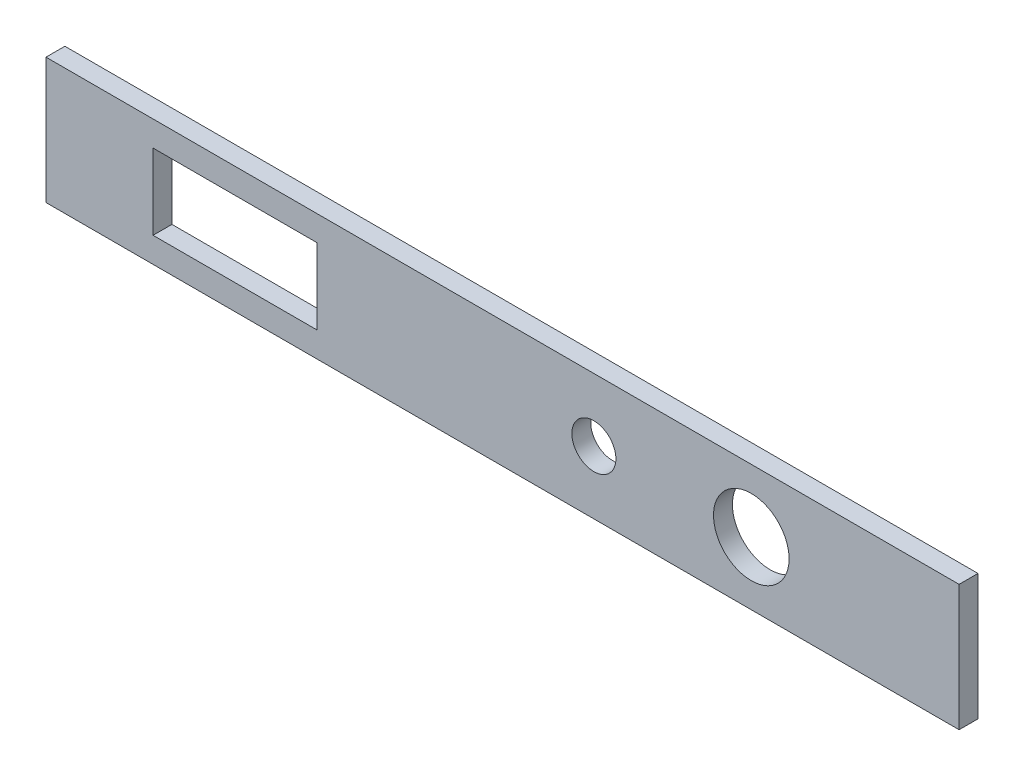
ISO-10303-21;
HEADER;
FILE_DESCRIPTION(('STEP AP214'),'2;1');
FILE_NAME('part.step','',(''),(''),'','','');
FILE_SCHEMA(('AUTOMOTIVE_DESIGN { 1 0 10303 214 1 1 1 1 }'));
ENDSEC;
DATA;
#1=APPLICATION_CONTEXT('core data for automotive mechanical design processes');
#2=APPLICATION_PROTOCOL_DEFINITION('international standard','automotive_design',2000,#1);
#3=PRODUCT_CONTEXT('',#1,'mechanical');
#4=PRODUCT('Part','Part','',(#3));
#5=PRODUCT_RELATED_PRODUCT_CATEGORY('part','',(#4));
#6=PRODUCT_DEFINITION_FORMATION('','',#4);
#7=PRODUCT_DEFINITION_CONTEXT('part definition',#1,'design');
#8=PRODUCT_DEFINITION('design','',#6,#7);
#9=PRODUCT_DEFINITION_SHAPE('','',#8);
#10=(LENGTH_UNIT() NAMED_UNIT(*) SI_UNIT(.MILLI.,.METRE.));
#11=(NAMED_UNIT(*) PLANE_ANGLE_UNIT() SI_UNIT($,.RADIAN.));
#12=(NAMED_UNIT(*) SI_UNIT($,.STERADIAN.) SOLID_ANGLE_UNIT());
#13=UNCERTAINTY_MEASURE_WITH_UNIT(LENGTH_MEASURE(1.E-05),#10,'distance_accuracy_value','');
#14=(GEOMETRIC_REPRESENTATION_CONTEXT(3) GLOBAL_UNCERTAINTY_ASSIGNED_CONTEXT((#13)) GLOBAL_UNIT_ASSIGNED_CONTEXT((#10,
#11,#12)) REPRESENTATION_CONTEXT('',''));
#15=CARTESIAN_POINT('',(0.,0.,0.));
#16=DIRECTION('',(0.,0.,1.));
#17=DIRECTION('',(1.,0.,0.));
#18=AXIS2_PLACEMENT_3D('',#15,#16,#17);
#19=CARTESIAN_POINT('',(0.,0.,3.));
#20=DIRECTION('',(1.,0.,0.));
#21=DIRECTION('',(0.,0.,-1.));
#22=AXIS2_PLACEMENT_3D('',#19,#20,#21);
#23=PLANE('',#22);
#24=DIRECTION('',(0.,-1.,0.));
#25=VECTOR('',#24,1.);
#26=CARTESIAN_POINT('',(0.,0.,0.));
#27=LINE('',#26,#25);
#28=CARTESIAN_POINT('',(0.,20.,0.));
#29=VERTEX_POINT('',#28);
#30=CARTESIAN_POINT('',(0.,0.,0.));
#31=VERTEX_POINT('',#30);
#32=EDGE_CURVE('E148',#29,#31,#27,.T.);
#33=ORIENTED_EDGE('',*,*,#32,.T.);
#34=DIRECTION('',(0.,0.,-1.));
#35=VECTOR('',#34,1.);
#36=CARTESIAN_POINT('',(0.,0.,3.));
#37=LINE('',#36,#35);
#38=CARTESIAN_POINT('',(0.,0.,3.));
#39=VERTEX_POINT('',#38);
#40=EDGE_CURVE('E11',#39,#31,#37,.T.);
#41=ORIENTED_EDGE('',*,*,#40,.F.);
#42=DIRECTION('',(0.,-1.,0.));
#43=VECTOR('',#42,1.);
#44=CARTESIAN_POINT('',(0.,0.,3.));
#45=LINE('',#44,#43);
#46=CARTESIAN_POINT('',(0.,20.,3.));
#47=VERTEX_POINT('',#46);
#48=EDGE_CURVE('E169',#47,#39,#45,.T.);
#49=ORIENTED_EDGE('',*,*,#48,.F.);
#50=DIRECTION('',(0.,0.,-1.));
#51=VECTOR('',#50,1.);
#52=CARTESIAN_POINT('',(0.,20.,3.));
#53=LINE('',#52,#51);
#54=EDGE_CURVE('E183',#47,#29,#53,.T.);
#55=ORIENTED_EDGE('',*,*,#54,.T.);
#56=EDGE_LOOP('',(#33,#41,#49,#55));
#57=FACE_BOUND('',#56,.T.);
#58=ADVANCED_FACE('F39',(#57),#23,.F.);
#59=CARTESIAN_POINT('',(0.,0.,3.));
#60=DIRECTION('',(0.,1.,0.));
#61=DIRECTION('',(0.,0.,1.));
#62=AXIS2_PLACEMENT_3D('',#59,#60,#61);
#63=PLANE('',#62);
#64=DIRECTION('',(1.,0.,0.));
#65=VECTOR('',#64,1.);
#66=CARTESIAN_POINT('',(0.,0.,0.));
#67=LINE('',#66,#65);
#68=CARTESIAN_POINT('',(145.,0.,0.));
#69=VERTEX_POINT('',#68);
#70=EDGE_CURVE('E187',#31,#69,#67,.T.);
#71=ORIENTED_EDGE('',*,*,#70,.T.);
#72=DIRECTION('',(0.,0.,-1.));
#73=VECTOR('',#72,1.);
#74=CARTESIAN_POINT('',(145.,0.,3.));
#75=LINE('',#74,#73);
#76=CARTESIAN_POINT('',(145.,0.,3.));
#77=VERTEX_POINT('',#76);
#78=EDGE_CURVE('E47',#77,#69,#75,.T.);
#79=ORIENTED_EDGE('',*,*,#78,.F.);
#80=DIRECTION('',(1.,0.,0.));
#81=VECTOR('',#80,1.);
#82=CARTESIAN_POINT('',(0.,0.,3.));
#83=LINE('',#82,#81);
#84=EDGE_CURVE('E173',#39,#77,#83,.T.);
#85=ORIENTED_EDGE('',*,*,#84,.F.);
#86=ORIENTED_EDGE('',*,*,#40,.T.);
#87=EDGE_LOOP('',(#71,#79,#85,#86));
#88=FACE_BOUND('',#87,.T.);
#89=ADVANCED_FACE('F222',(#88),#63,.F.);
#90=CARTESIAN_POINT('',(145.,0.,3.));
#91=DIRECTION('',(-1.,0.,0.));
#92=DIRECTION('',(0.,0.,1.));
#93=AXIS2_PLACEMENT_3D('',#90,#91,#92);
#94=PLANE('',#93);
#95=DIRECTION('',(0.,1.,0.));
#96=VECTOR('',#95,1.);
#97=CARTESIAN_POINT('',(145.,0.,0.));
#98=LINE('',#97,#96);
#99=CARTESIAN_POINT('',(145.,20.,0.));
#100=VERTEX_POINT('',#99);
#101=EDGE_CURVE('E190',#69,#100,#98,.T.);
#102=ORIENTED_EDGE('',*,*,#101,.T.);
#103=DIRECTION('',(0.,0.,-1.));
#104=VECTOR('',#103,1.);
#105=CARTESIAN_POINT('',(145.,20.,3.));
#106=LINE('',#105,#104);
#107=CARTESIAN_POINT('',(145.,20.,3.));
#108=VERTEX_POINT('',#107);
#109=EDGE_CURVE('E198',#108,#100,#106,.T.);
#110=ORIENTED_EDGE('',*,*,#109,.F.);
#111=DIRECTION('',(0.,1.,0.));
#112=VECTOR('',#111,1.);
#113=CARTESIAN_POINT('',(145.,0.,3.));
#114=LINE('',#113,#112);
#115=EDGE_CURVE('E177',#77,#108,#114,.T.);
#116=ORIENTED_EDGE('',*,*,#115,.F.);
#117=ORIENTED_EDGE('',*,*,#78,.T.);
#118=EDGE_LOOP('',(#102,#110,#116,#117));
#119=FACE_BOUND('',#118,.T.);
#120=ADVANCED_FACE('F207',(#119),#94,.F.);
#121=CARTESIAN_POINT('',(0.,20.,3.));
#122=DIRECTION('',(0.,-1.,0.));
#123=DIRECTION('',(0.,0.,-1.));
#124=AXIS2_PLACEMENT_3D('',#121,#122,#123);
#125=PLANE('',#124);
#126=DIRECTION('',(-1.,0.,0.));
#127=VECTOR('',#126,1.);
#128=CARTESIAN_POINT('',(0.,20.,0.));
#129=LINE('',#128,#127);
#130=EDGE_CURVE('E174',#100,#29,#129,.T.);
#131=ORIENTED_EDGE('',*,*,#130,.T.);
#132=ORIENTED_EDGE('',*,*,#54,.F.);
#133=DIRECTION('',(-1.,0.,0.));
#134=VECTOR('',#133,1.);
#135=CARTESIAN_POINT('',(0.,20.,3.));
#136=LINE('',#135,#134);
#137=EDGE_CURVE('E180',#108,#47,#136,.T.);
#138=ORIENTED_EDGE('',*,*,#137,.F.);
#139=ORIENTED_EDGE('',*,*,#109,.T.);
#140=EDGE_LOOP('',(#131,#132,#138,#139));
#141=FACE_BOUND('',#140,.T.);
#142=ADVANCED_FACE('F215',(#141),#125,.F.);
#143=CARTESIAN_POINT('',(0.,0.,3.));
#144=DIRECTION('',(0.,0.,-1.));
#145=DIRECTION('',(-1.,0.,0.));
#146=AXIS2_PLACEMENT_3D('',#143,#144,#145);
#147=PLANE('',#146);
#148=DIRECTION('',(1.,0.,0.));
#149=VECTOR('',#148,1.);
#150=CARTESIAN_POINT('',(17.,4.,3.));
#151=LINE('',#150,#149);
#152=CARTESIAN_POINT('',(17.,4.,3.));
#153=VERTEX_POINT('',#152);
#154=CARTESIAN_POINT('',(43.,4.00000000000002,3.));
#155=VERTEX_POINT('',#154);
#156=EDGE_CURVE('E138',#153,#155,#151,.T.);
#157=ORIENTED_EDGE('',*,*,#156,.F.);
#158=DIRECTION('',(0.,-1.,0.));
#159=VECTOR('',#158,1.);
#160=CARTESIAN_POINT('',(17.,16.,3.));
#161=LINE('',#160,#159);
#162=CARTESIAN_POINT('',(17.,16.,3.));
#163=VERTEX_POINT('',#162);
#164=EDGE_CURVE('E54',#163,#153,#161,.T.);
#165=ORIENTED_EDGE('',*,*,#164,.F.);
#166=DIRECTION('',(-1.,0.,0.));
#167=VECTOR('',#166,1.);
#168=CARTESIAN_POINT('',(17.,16.,3.));
#169=LINE('',#168,#167);
#170=CARTESIAN_POINT('',(43.,16.,3.));
#171=VERTEX_POINT('',#170);
#172=EDGE_CURVE('E125',#171,#163,#169,.T.);
#173=ORIENTED_EDGE('',*,*,#172,.F.);
#174=DIRECTION('',(0.,1.,0.));
#175=VECTOR('',#174,1.);
#176=CARTESIAN_POINT('',(43.,16.,3.));
#177=LINE('',#176,#175);
#178=EDGE_CURVE('E129',#155,#171,#177,.T.);
#179=ORIENTED_EDGE('',*,*,#178,.F.);
#180=EDGE_LOOP('',(#157,#165,#173,#179));
#181=FACE_BOUND('',#180,.T.);
#182=CARTESIAN_POINT('',(87.,10.,3.));
#183=DIRECTION('',(0.,0.,1.));
#184=DIRECTION('',(1.,0.,0.));
#185=AXIS2_PLACEMENT_3D('',#182,#183,#184);
#186=CIRCLE('',#185,3.49999999999996);
#187=CARTESIAN_POINT('',(90.5,10.,3.));
#188=VERTEX_POINT('',#187);
#189=EDGE_CURVE('E157',#188,#188,#186,.T.);
#190=ORIENTED_EDGE('',*,*,#189,.F.);
#191=EDGE_LOOP('',(#190));
#192=FACE_BOUND('',#191,.T.);
#193=CARTESIAN_POINT('',(112.,10.,3.));
#194=DIRECTION('',(0.,0.,1.));
#195=DIRECTION('',(1.,0.,0.));
#196=AXIS2_PLACEMENT_3D('',#193,#194,#195);
#197=CIRCLE('',#196,6.00000000000002);
#198=CARTESIAN_POINT('',(118.,10.,3.));
#199=VERTEX_POINT('',#198);
#200=EDGE_CURVE('E165',#199,#199,#197,.T.);
#201=ORIENTED_EDGE('',*,*,#200,.F.);
#202=EDGE_LOOP('',(#201));
#203=FACE_BOUND('',#202,.T.);
#204=ORIENTED_EDGE('',*,*,#48,.T.);
#205=ORIENTED_EDGE('',*,*,#84,.T.);
#206=ORIENTED_EDGE('',*,*,#115,.T.);
#207=ORIENTED_EDGE('',*,*,#137,.T.);
#208=EDGE_LOOP('',(#204,#205,#206,#207));
#209=FACE_BOUND('',#208,.T.);
#210=ADVANCED_FACE('F221',(#181,#192,#203,#209),#147,.F.);
#211=CARTESIAN_POINT('',(0.,0.,0.));
#212=DIRECTION('',(0.,0.,-1.));
#213=DIRECTION('',(-1.,0.,0.));
#214=AXIS2_PLACEMENT_3D('',#211,#212,#213);
#215=PLANE('',#214);
#216=DIRECTION('',(0.,-1.,0.));
#217=VECTOR('',#216,1.);
#218=CARTESIAN_POINT('',(17.,16.,0.));
#219=LINE('',#218,#217);
#220=CARTESIAN_POINT('',(17.,16.,0.));
#221=VERTEX_POINT('',#220);
#222=CARTESIAN_POINT('',(17.,4.,0.));
#223=VERTEX_POINT('',#222);
#224=EDGE_CURVE('E106',#221,#223,#219,.T.);
#225=ORIENTED_EDGE('',*,*,#224,.T.);
#226=DIRECTION('',(1.,0.,0.));
#227=VECTOR('',#226,1.);
#228=CARTESIAN_POINT('',(17.,4.,0.));
#229=LINE('',#228,#227);
#230=CARTESIAN_POINT('',(43.,4.00000000000002,0.));
#231=VERTEX_POINT('',#230);
#232=EDGE_CURVE('E116',#223,#231,#229,.T.);
#233=ORIENTED_EDGE('',*,*,#232,.T.);
#234=DIRECTION('',(0.,1.,0.));
#235=VECTOR('',#234,1.);
#236=CARTESIAN_POINT('',(43.,16.,0.));
#237=LINE('',#236,#235);
#238=CARTESIAN_POINT('',(43.,16.,0.));
#239=VERTEX_POINT('',#238);
#240=EDGE_CURVE('E62',#231,#239,#237,.T.);
#241=ORIENTED_EDGE('',*,*,#240,.T.);
#242=DIRECTION('',(-1.,0.,0.));
#243=VECTOR('',#242,1.);
#244=CARTESIAN_POINT('',(17.,16.,0.));
#245=LINE('',#244,#243);
#246=EDGE_CURVE('E113',#239,#221,#245,.T.);
#247=ORIENTED_EDGE('',*,*,#246,.T.);
#248=EDGE_LOOP('',(#225,#233,#241,#247));
#249=FACE_BOUND('',#248,.T.);
#250=CARTESIAN_POINT('',(87.,10.,0.));
#251=DIRECTION('',(0.,0.,1.));
#252=DIRECTION('',(1.,0.,0.));
#253=AXIS2_PLACEMENT_3D('',#250,#251,#252);
#254=CIRCLE('',#253,3.49999999999996);
#255=CARTESIAN_POINT('',(90.5,10.,0.));
#256=VERTEX_POINT('',#255);
#257=EDGE_CURVE('E139',#256,#256,#254,.T.);
#258=ORIENTED_EDGE('',*,*,#257,.T.);
#259=EDGE_LOOP('',(#258));
#260=FACE_BOUND('',#259,.T.);
#261=CARTESIAN_POINT('',(112.,10.,0.));
#262=DIRECTION('',(0.,0.,1.));
#263=DIRECTION('',(1.,0.,0.));
#264=AXIS2_PLACEMENT_3D('',#261,#262,#263);
#265=CIRCLE('',#264,6.00000000000002);
#266=CARTESIAN_POINT('',(118.,10.,0.));
#267=VERTEX_POINT('',#266);
#268=EDGE_CURVE('E161',#267,#267,#265,.T.);
#269=ORIENTED_EDGE('',*,*,#268,.T.);
#270=EDGE_LOOP('',(#269));
#271=FACE_BOUND('',#270,.T.);
#272=ORIENTED_EDGE('',*,*,#32,.F.);
#273=ORIENTED_EDGE('',*,*,#130,.F.);
#274=ORIENTED_EDGE('',*,*,#101,.F.);
#275=ORIENTED_EDGE('',*,*,#70,.F.);
#276=EDGE_LOOP('',(#272,#273,#274,#275));
#277=FACE_BOUND('',#276,.T.);
#278=ADVANCED_FACE('F121',(#249,#260,#271,#277),#215,.T.);
#279=CARTESIAN_POINT('',(112.,10.,0.));
#280=DIRECTION('',(0.,0.,1.));
#281=DIRECTION('',(1.,0.,0.));
#282=AXIS2_PLACEMENT_3D('',#279,#280,#281);
#283=CYLINDRICAL_SURFACE('',#282,6.00000000000002);
#284=ORIENTED_EDGE('',*,*,#268,.F.);
#285=EDGE_LOOP('',(#284));
#286=FACE_BOUND('',#285,.T.);
#287=ORIENTED_EDGE('',*,*,#200,.T.);
#288=EDGE_LOOP('',(#287));
#289=FACE_BOUND('',#288,.T.);
#290=ADVANCED_FACE('F234',(#286,#289),#283,.F.);
#291=CARTESIAN_POINT('',(87.,10.,0.));
#292=DIRECTION('',(0.,0.,1.));
#293=DIRECTION('',(1.,0.,0.));
#294=AXIS2_PLACEMENT_3D('',#291,#292,#293);
#295=CYLINDRICAL_SURFACE('',#294,3.49999999999996);
#296=ORIENTED_EDGE('',*,*,#257,.F.);
#297=EDGE_LOOP('',(#296));
#298=FACE_BOUND('',#297,.T.);
#299=ORIENTED_EDGE('',*,*,#189,.T.);
#300=EDGE_LOOP('',(#299));
#301=FACE_BOUND('',#300,.T.);
#302=ADVANCED_FACE('F240',(#298,#301),#295,.F.);
#303=CARTESIAN_POINT('',(17.,16.,0.));
#304=DIRECTION('',(-1.,0.,0.));
#305=DIRECTION('',(0.,-1.,0.));
#306=AXIS2_PLACEMENT_3D('',#303,#304,#305);
#307=PLANE('',#306);
#308=ORIENTED_EDGE('',*,*,#164,.T.);
#309=DIRECTION('',(0.,0.,1.));
#310=VECTOR('',#309,1.);
#311=CARTESIAN_POINT('',(17.,4.,0.));
#312=LINE('',#311,#310);
#313=EDGE_CURVE('E102',#223,#153,#312,.T.);
#314=ORIENTED_EDGE('',*,*,#313,.F.);
#315=ORIENTED_EDGE('',*,*,#224,.F.);
#316=DIRECTION('',(0.,0.,1.));
#317=VECTOR('',#316,1.);
#318=CARTESIAN_POINT('',(17.,16.,0.));
#319=LINE('',#318,#317);
#320=EDGE_CURVE('E145',#221,#163,#319,.T.);
#321=ORIENTED_EDGE('',*,*,#320,.T.);
#322=EDGE_LOOP('',(#308,#314,#315,#321));
#323=FACE_BOUND('',#322,.T.);
#324=ADVANCED_FACE('F104',(#323),#307,.F.);
#325=CARTESIAN_POINT('',(17.,16.,0.));
#326=DIRECTION('',(0.,1.,0.));
#327=DIRECTION('',(0.,0.,1.));
#328=AXIS2_PLACEMENT_3D('',#325,#326,#327);
#329=PLANE('',#328);
#330=ORIENTED_EDGE('',*,*,#172,.T.);
#331=ORIENTED_EDGE('',*,*,#320,.F.);
#332=ORIENTED_EDGE('',*,*,#246,.F.);
#333=DIRECTION('',(0.,0.,1.));
#334=VECTOR('',#333,1.);
#335=CARTESIAN_POINT('',(43.,16.,0.));
#336=LINE('',#335,#334);
#337=EDGE_CURVE('E149',#239,#171,#336,.T.);
#338=ORIENTED_EDGE('',*,*,#337,.T.);
#339=EDGE_LOOP('',(#330,#331,#332,#338));
#340=FACE_BOUND('',#339,.T.);
#341=ADVANCED_FACE('F247',(#340),#329,.F.);
#342=CARTESIAN_POINT('',(43.,16.,0.));
#343=DIRECTION('',(1.,0.,0.));
#344=DIRECTION('',(0.,1.,0.));
#345=AXIS2_PLACEMENT_3D('',#342,#343,#344);
#346=PLANE('',#345);
#347=ORIENTED_EDGE('',*,*,#178,.T.);
#348=ORIENTED_EDGE('',*,*,#337,.F.);
#349=ORIENTED_EDGE('',*,*,#240,.F.);
#350=DIRECTION('',(0.,0.,1.));
#351=VECTOR('',#350,1.);
#352=CARTESIAN_POINT('',(43.,4.00000000000002,0.));
#353=LINE('',#352,#351);
#354=EDGE_CURVE('E112',#231,#155,#353,.T.);
#355=ORIENTED_EDGE('',*,*,#354,.T.);
#356=EDGE_LOOP('',(#347,#348,#349,#355));
#357=FACE_BOUND('',#356,.T.);
#358=ADVANCED_FACE('F250',(#357),#346,.F.);
#359=CARTESIAN_POINT('',(17.,4.,0.));
#360=DIRECTION('',(0.,-1.,0.));
#361=DIRECTION('',(1.,0.,0.));
#362=AXIS2_PLACEMENT_3D('',#359,#360,#361);
#363=PLANE('',#362);
#364=ORIENTED_EDGE('',*,*,#156,.T.);
#365=ORIENTED_EDGE('',*,*,#354,.F.);
#366=ORIENTED_EDGE('',*,*,#232,.F.);
#367=ORIENTED_EDGE('',*,*,#313,.T.);
#368=EDGE_LOOP('',(#364,#365,#366,#367));
#369=FACE_BOUND('',#368,.T.);
#370=ADVANCED_FACE('F117',(#369),#363,.F.);
#371=CLOSED_SHELL('',(#58,#89,#120,#142,#210,#278,#290,#302,#324,#341,#358,#370));
#372=MANIFOLD_SOLID_BREP('B2',#371);
#373=ADVANCED_BREP_SHAPE_REPRESENTATION('',(#18,#372),#14);
#374=SHAPE_DEFINITION_REPRESENTATION(#9,#373);
ENDSEC;
END-ISO-10303-21;
